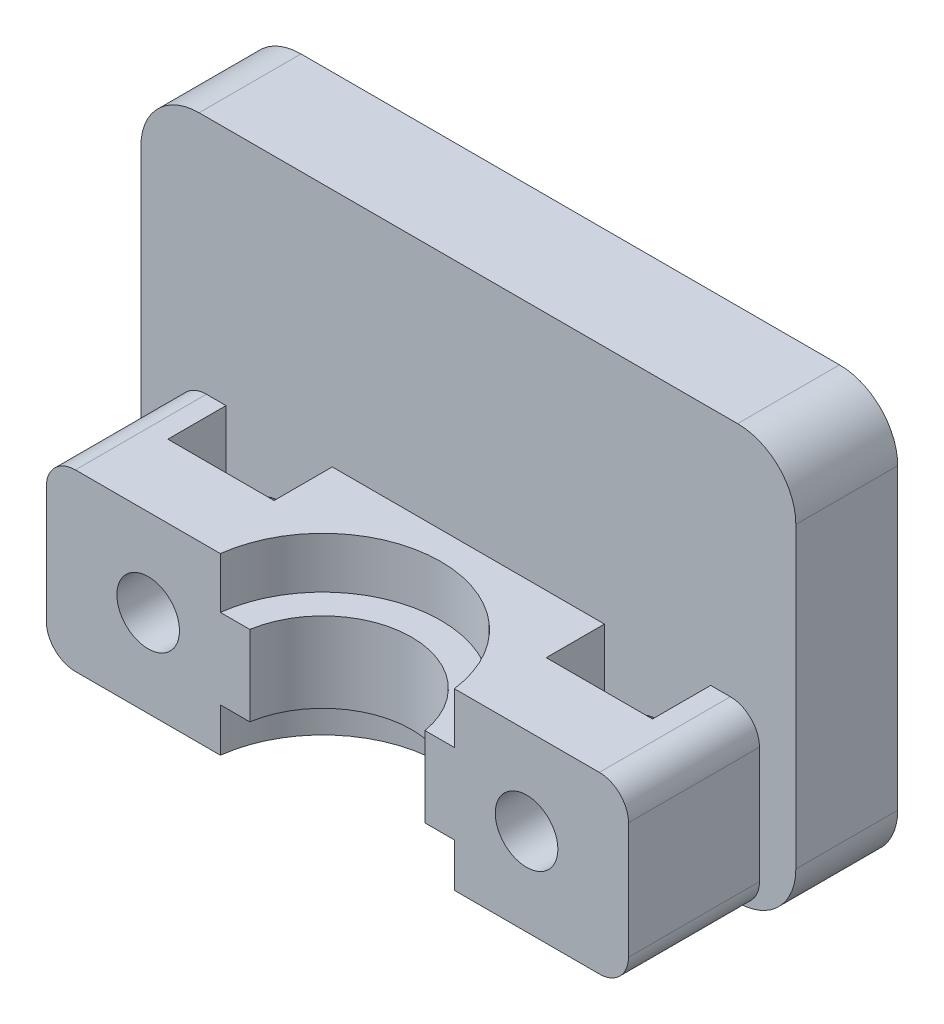
ISO-10303-21;
HEADER;
FILE_DESCRIPTION(('STEP AP214'),'2;1');
FILE_NAME('part.step','',(''),(''),'','','');
FILE_SCHEMA(('AUTOMOTIVE_DESIGN { 1 0 10303 214 1 1 1 1 }'));
ENDSEC;
DATA;
#1=APPLICATION_CONTEXT('core data for automotive mechanical design processes');
#2=APPLICATION_PROTOCOL_DEFINITION('international standard','automotive_design',2000,#1);
#3=PRODUCT_CONTEXT('',#1,'mechanical');
#4=PRODUCT('Part','Part','',(#3));
#5=PRODUCT_RELATED_PRODUCT_CATEGORY('part','',(#4));
#6=PRODUCT_DEFINITION_FORMATION('','',#4);
#7=PRODUCT_DEFINITION_CONTEXT('part definition',#1,'design');
#8=PRODUCT_DEFINITION('design','',#6,#7);
#9=PRODUCT_DEFINITION_SHAPE('','',#8);
#10=(LENGTH_UNIT() NAMED_UNIT(*) SI_UNIT(.MILLI.,.METRE.));
#11=(NAMED_UNIT(*) PLANE_ANGLE_UNIT() SI_UNIT($,.RADIAN.));
#12=(NAMED_UNIT(*) SI_UNIT($,.STERADIAN.) SOLID_ANGLE_UNIT());
#13=UNCERTAINTY_MEASURE_WITH_UNIT(LENGTH_MEASURE(1.E-05),#10,'distance_accuracy_value','');
#14=(GEOMETRIC_REPRESENTATION_CONTEXT(3) GLOBAL_UNCERTAINTY_ASSIGNED_CONTEXT((#13)) GLOBAL_UNIT_ASSIGNED_CONTEXT((#10,
#11,#12)) REPRESENTATION_CONTEXT('',''));
#15=CARTESIAN_POINT('',(0.,0.,0.));
#16=DIRECTION('',(0.,0.,1.));
#17=DIRECTION('',(1.,0.,0.));
#18=AXIS2_PLACEMENT_3D('',#15,#16,#17);
#19=CARTESIAN_POINT('',(-18.5,18.5,6.));
#20=DIRECTION('',(0.,0.,-1.));
#21=DIRECTION('',(1.,0.,0.));
#22=AXIS2_PLACEMENT_3D('',#19,#20,#21);
#23=CYLINDRICAL_SURFACE('',#22,4.);
#24=DIRECTION('',(0.,0.,1.));
#25=VECTOR('',#24,1.);
#26=CARTESIAN_POINT('',(-18.5,22.5,6.));
#27=LINE('',#26,#25);
#28=CARTESIAN_POINT('',(-18.5,22.5,8.));
#29=VERTEX_POINT('',#28);
#30=CARTESIAN_POINT('',(-18.5,22.5,15.));
#31=VERTEX_POINT('',#30);
#32=EDGE_CURVE('E373',#29,#31,#27,.T.);
#33=ORIENTED_EDGE('',*,*,#32,.F.);
#34=CARTESIAN_POINT('',(-18.5,18.5,8.));
#35=DIRECTION('',(0.,0.,-1.));
#36=DIRECTION('',(-1.,0.,0.));
#37=AXIS2_PLACEMENT_3D('',#34,#35,#36);
#38=CIRCLE('',#37,4.);
#39=CARTESIAN_POINT('',(-22.5,18.5,8.));
#40=VERTEX_POINT('',#39);
#41=EDGE_CURVE('E258',#40,#29,#38,.T.);
#42=ORIENTED_EDGE('',*,*,#41,.F.);
#43=DIRECTION('',(0.,0.,-1.));
#44=VECTOR('',#43,1.);
#45=CARTESIAN_POINT('',(-22.5,18.5,0.));
#46=LINE('',#45,#44);
#47=CARTESIAN_POINT('',(-22.5,18.5,15.));
#48=VERTEX_POINT('',#47);
#49=EDGE_CURVE('E256',#48,#40,#46,.T.);
#50=ORIENTED_EDGE('',*,*,#49,.F.);
#51=CARTESIAN_POINT('',(-18.5,18.5,15.));
#52=DIRECTION('',(0.,0.,-1.));
#53=DIRECTION('',(-1.,0.,0.));
#54=AXIS2_PLACEMENT_3D('',#51,#52,#53);
#55=CIRCLE('',#54,4.);
#56=EDGE_CURVE('E540',#48,#31,#55,.T.);
#57=ORIENTED_EDGE('',*,*,#56,.T.);
#58=EDGE_LOOP('',(#33,#42,#50,#57));
#59=FACE_BOUND('',#58,.T.);
#60=ADVANCED_FACE('F41',(#59),#23,.T.);
#61=CARTESIAN_POINT('',(18.5,18.5,6.));
#62=DIRECTION('',(0.,0.,1.));
#63=DIRECTION('',(-1.,0.,0.));
#64=AXIS2_PLACEMENT_3D('',#61,#62,#63);
#65=CYLINDRICAL_SURFACE('',#64,4.);
#66=DIRECTION('',(0.,0.,1.));
#67=VECTOR('',#66,1.);
#68=CARTESIAN_POINT('',(22.5,18.5,6.));
#69=LINE('',#68,#67);
#70=CARTESIAN_POINT('',(22.5,18.5,8.));
#71=VERTEX_POINT('',#70);
#72=CARTESIAN_POINT('',(22.5,18.5,15.));
#73=VERTEX_POINT('',#72);
#74=EDGE_CURVE('E467',#71,#73,#69,.T.);
#75=ORIENTED_EDGE('',*,*,#74,.F.);
#76=CARTESIAN_POINT('',(18.5,18.5,8.));
#77=DIRECTION('',(0.,0.,-1.));
#78=DIRECTION('',(-1.,0.,0.));
#79=AXIS2_PLACEMENT_3D('',#76,#77,#78);
#80=CIRCLE('',#79,4.);
#81=CARTESIAN_POINT('',(18.5,22.5,8.));
#82=VERTEX_POINT('',#81);
#83=EDGE_CURVE('E579',#82,#71,#80,.T.);
#84=ORIENTED_EDGE('',*,*,#83,.F.);
#85=DIRECTION('',(0.,0.,-1.));
#86=VECTOR('',#85,1.);
#87=CARTESIAN_POINT('',(18.5,22.5,6.));
#88=LINE('',#87,#86);
#89=CARTESIAN_POINT('',(18.5,22.5,15.));
#90=VERTEX_POINT('',#89);
#91=EDGE_CURVE('E369',#90,#82,#88,.T.);
#92=ORIENTED_EDGE('',*,*,#91,.F.);
#93=CARTESIAN_POINT('',(18.5,18.5,15.));
#94=DIRECTION('',(0.,0.,-1.));
#95=DIRECTION('',(-1.,0.,0.));
#96=AXIS2_PLACEMENT_3D('',#93,#94,#95);
#97=CIRCLE('',#96,4.);
#98=EDGE_CURVE('E532',#90,#73,#97,.T.);
#99=ORIENTED_EDGE('',*,*,#98,.T.);
#100=EDGE_LOOP('',(#75,#84,#92,#99));
#101=FACE_BOUND('',#100,.T.);
#102=ADVANCED_FACE('F618',(#101),#65,.T.);
#103=CARTESIAN_POINT('',(0.,22.5,6.));
#104=DIRECTION('',(0.,1.,0.));
#105=DIRECTION('',(1.,0.,0.));
#106=AXIS2_PLACEMENT_3D('',#103,#104,#105);
#107=PLANE('',#106);
#108=ORIENTED_EDGE('',*,*,#91,.T.);
#109=DIRECTION('',(1.,0.,0.));
#110=VECTOR('',#109,1.);
#111=CARTESIAN_POINT('',(-18.5,22.5,8.));
#112=LINE('',#111,#110);
#113=EDGE_CURVE('E582',#29,#82,#112,.T.);
#114=ORIENTED_EDGE('',*,*,#113,.F.);
#115=ORIENTED_EDGE('',*,*,#32,.T.);
#116=DIRECTION('',(1.,0.,0.));
#117=VECTOR('',#116,1.);
#118=CARTESIAN_POINT('',(18.5,22.5,15.));
#119=LINE('',#118,#117);
#120=EDGE_CURVE('E536',#31,#90,#119,.T.);
#121=ORIENTED_EDGE('',*,*,#120,.T.);
#122=EDGE_LOOP('',(#108,#114,#115,#121));
#123=FACE_BOUND('',#122,.T.);
#124=ADVANCED_FACE('F625',(#123),#107,.T.);
#125=CARTESIAN_POINT('',(-22.5,0.,6.));
#126=DIRECTION('',(1.,0.,0.));
#127=DIRECTION('',(0.,0.,1.));
#128=AXIS2_PLACEMENT_3D('',#125,#126,#127);
#129=PLANE('',#128);
#130=DIRECTION('',(0.,1.,0.));
#131=VECTOR('',#130,1.);
#132=CARTESIAN_POINT('',(-22.5,-2.,8.));
#133=LINE('',#132,#131);
#134=CARTESIAN_POINT('',(-22.5,-2.,8.));
#135=VERTEX_POINT('',#134);
#136=EDGE_CURVE('E240',#135,#40,#133,.T.);
#137=ORIENTED_EDGE('',*,*,#136,.F.);
#138=DIRECTION('',(0.,0.,-1.));
#139=VECTOR('',#138,1.);
#140=CARTESIAN_POINT('',(-22.5,-2.,6.));
#141=LINE('',#140,#139);
#142=CARTESIAN_POINT('',(-22.5,-2.,15.));
#143=VERTEX_POINT('',#142);
#144=EDGE_CURVE('E254',#135,#143,#141,.F.);
#145=ORIENTED_EDGE('',*,*,#144,.T.);
#146=DIRECTION('',(0.,1.,0.));
#147=VECTOR('',#146,1.);
#148=CARTESIAN_POINT('',(-22.5,18.5,15.));
#149=LINE('',#148,#147);
#150=EDGE_CURVE('E544',#143,#48,#149,.T.);
#151=ORIENTED_EDGE('',*,*,#150,.T.);
#152=ORIENTED_EDGE('',*,*,#49,.T.);
#153=EDGE_LOOP('',(#137,#145,#151,#152));
#154=FACE_BOUND('',#153,.T.);
#155=ADVANCED_FACE('F252',(#154),#129,.F.);
#156=CARTESIAN_POINT('',(-3.48623514175416,-6.,24.));
#157=DIRECTION('',(0.,1.,0.));
#158=DIRECTION('',(1.,0.,0.));
#159=AXIS2_PLACEMENT_3D('',#156,#157,#158);
#160=PLANE('',#159);
#161=DIRECTION('',(1.,0.,0.));
#162=VECTOR('',#161,1.);
#163=CARTESIAN_POINT('',(-12.7345621585846,-6.,15.));
#164=LINE('',#163,#162);
#165=CARTESIAN_POINT('',(-16.65,-6.,15.));
#166=VERTEX_POINT('',#165);
#167=CARTESIAN_POINT('',(-9.35,-6.,15.));
#168=VERTEX_POINT('',#167);
#169=EDGE_CURVE('E277',#166,#168,#164,.T.);
#170=ORIENTED_EDGE('',*,*,#169,.F.);
#171=DIRECTION('',(0.,0.,-1.));
#172=VECTOR('',#171,1.);
#173=CARTESIAN_POINT('',(-16.65,-6.,16.4911967590451));
#174=LINE('',#173,#172);
#175=CARTESIAN_POINT('',(-16.65,-6.,19.));
#176=VERTEX_POINT('',#175);
#177=EDGE_CURVE('E400',#176,#166,#174,.T.);
#178=ORIENTED_EDGE('',*,*,#177,.F.);
#179=DIRECTION('',(1.,0.,0.));
#180=VECTOR('',#179,1.);
#181=CARTESIAN_POINT('',(-12.7345621585846,-6.,19.));
#182=LINE('',#181,#180);
#183=CARTESIAN_POINT('',(-9.35,-6.,19.));
#184=VERTEX_POINT('',#183);
#185=EDGE_CURVE('E421',#176,#184,#182,.T.);
#186=ORIENTED_EDGE('',*,*,#185,.T.);
#187=DIRECTION('',(0.,0.,-1.));
#188=VECTOR('',#187,1.);
#189=CARTESIAN_POINT('',(-9.35,-6.,17.5088032409549));
#190=LINE('',#189,#188);
#191=EDGE_CURVE('E424',#184,#168,#190,.T.);
#192=ORIENTED_EDGE('',*,*,#191,.T.);
#193=EDGE_LOOP('',(#170,#178,#186,#192));
#194=FACE_BOUND('',#193,.T.);
#195=DIRECTION('',(-1.,0.,0.));
#196=VECTOR('',#195,1.);
#197=CARTESIAN_POINT('',(13.6458841152489,-6.,15.));
#198=LINE('',#197,#196);
#199=CARTESIAN_POINT('',(16.65,-6.,15.));
#200=VERTEX_POINT('',#199);
#201=CARTESIAN_POINT('',(9.35,-6.,15.));
#202=VERTEX_POINT('',#201);
#203=EDGE_CURVE('E492',#200,#202,#198,.T.);
#204=ORIENTED_EDGE('',*,*,#203,.T.);
#205=DIRECTION('',(0.,0.,-1.));
#206=VECTOR('',#205,1.);
#207=CARTESIAN_POINT('',(9.35,-6.,16.4911967590451));
#208=LINE('',#207,#206);
#209=CARTESIAN_POINT('',(9.35,-6.,19.));
#210=VERTEX_POINT('',#209);
#211=EDGE_CURVE('E314',#210,#202,#208,.T.);
#212=ORIENTED_EDGE('',*,*,#211,.F.);
#213=DIRECTION('',(-1.,0.,0.));
#214=VECTOR('',#213,1.);
#215=CARTESIAN_POINT('',(13.6458841152489,-6.,19.));
#216=LINE('',#215,#214);
#217=CARTESIAN_POINT('',(16.65,-6.,19.));
#218=VERTEX_POINT('',#217);
#219=EDGE_CURVE('E283',#218,#210,#216,.T.);
#220=ORIENTED_EDGE('',*,*,#219,.F.);
#221=DIRECTION('',(0.,0.,-1.));
#222=VECTOR('',#221,1.);
#223=CARTESIAN_POINT('',(16.65,-6.,16.4911967590451));
#224=LINE('',#223,#222);
#225=EDGE_CURVE('E385',#218,#200,#224,.T.);
#226=ORIENTED_EDGE('',*,*,#225,.T.);
#227=EDGE_LOOP('',(#204,#212,#220,#226));
#228=FACE_BOUND('',#227,.T.);
#229=DIRECTION('',(-1.,0.,0.));
#230=VECTOR('',#229,1.);
#231=CARTESIAN_POINT('',(18.5,-6.,8.));
#232=LINE('',#231,#230);
#233=CARTESIAN_POINT('',(18.5,-6.,8.));
#234=VERTEX_POINT('',#233);
#235=CARTESIAN_POINT('',(-18.5,-6.,8.));
#236=VERTEX_POINT('',#235);
#237=EDGE_CURVE('E243',#234,#236,#232,.T.);
#238=ORIENTED_EDGE('',*,*,#237,.F.);
#239=DIRECTION('',(0.,0.,-1.));
#240=VECTOR('',#239,1.);
#241=CARTESIAN_POINT('',(18.5,-6.,6.));
#242=LINE('',#241,#240);
#243=CARTESIAN_POINT('',(18.5,-6.,15.));
#244=VERTEX_POINT('',#243);
#245=EDGE_CURVE('E271',#234,#244,#242,.F.);
#246=ORIENTED_EDGE('',*,*,#245,.T.);
#247=DIRECTION('',(-1.,0.,0.));
#248=VECTOR('',#247,1.);
#249=CARTESIAN_POINT('',(18.,-6.,15.));
#250=LINE('',#249,#248);
#251=CARTESIAN_POINT('',(18.,-6.,15.));
#252=VERTEX_POINT('',#251);
#253=EDGE_CURVE('E520',#244,#252,#250,.T.);
#254=ORIENTED_EDGE('',*,*,#253,.T.);
#255=DIRECTION('',(0.,0.,1.));
#256=VECTOR('',#255,1.);
#257=CARTESIAN_POINT('',(18.,-6.,24.));
#258=LINE('',#257,#256);
#259=CARTESIAN_POINT('',(18.,-6.,24.));
#260=VERTEX_POINT('',#259);
#261=EDGE_CURVE('E397',#252,#260,#258,.T.);
#262=ORIENTED_EDGE('',*,*,#261,.T.);
#263=DIRECTION('',(1.,0.,0.));
#264=VECTOR('',#263,1.);
#265=CARTESIAN_POINT('',(-3.48623514175416,-6.,24.));
#266=LINE('',#265,#264);
#267=CARTESIAN_POINT('',(8.03803458564343,-6.,24.));
#268=VERTEX_POINT('',#267);
#269=EDGE_CURVE('E303',#268,#260,#266,.T.);
#270=ORIENTED_EDGE('',*,*,#269,.F.);
#271=CARTESIAN_POINT('',(0.,-6.,25.));
#272=DIRECTION('',(0.,-1.,0.));
#273=DIRECTION('',(1.,0.,0.));
#274=AXIS2_PLACEMENT_3D('',#271,#272,#273);
#275=CIRCLE('',#274,8.1);
#276=CARTESIAN_POINT('',(-8.03803458564343,-6.,24.));
#277=VERTEX_POINT('',#276);
#278=EDGE_CURVE('E296',#277,#268,#275,.T.);
#279=ORIENTED_EDGE('',*,*,#278,.F.);
#280=DIRECTION('',(1.,0.,0.));
#281=VECTOR('',#280,1.);
#282=CARTESIAN_POINT('',(-3.48623514175416,-6.,24.));
#283=LINE('',#282,#281);
#284=CARTESIAN_POINT('',(-18.,-6.,24.));
#285=VERTEX_POINT('',#284);
#286=EDGE_CURVE('E301',#285,#277,#283,.T.);
#287=ORIENTED_EDGE('',*,*,#286,.F.);
#288=DIRECTION('',(0.,0.,-1.));
#289=VECTOR('',#288,1.);
#290=CARTESIAN_POINT('',(-18.,-6.,24.));
#291=LINE('',#290,#289);
#292=CARTESIAN_POINT('',(-18.,-6.,15.));
#293=VERTEX_POINT('',#292);
#294=EDGE_CURVE('E348',#285,#293,#291,.T.);
#295=ORIENTED_EDGE('',*,*,#294,.T.);
#296=DIRECTION('',(-1.,0.,0.));
#297=VECTOR('',#296,1.);
#298=CARTESIAN_POINT('',(-18.5,-6.,15.));
#299=LINE('',#298,#297);
#300=CARTESIAN_POINT('',(-18.5,-6.,15.));
#301=VERTEX_POINT('',#300);
#302=EDGE_CURVE('E549',#293,#301,#299,.T.);
#303=ORIENTED_EDGE('',*,*,#302,.T.);
#304=DIRECTION('',(0.,0.,-1.));
#305=VECTOR('',#304,1.);
#306=CARTESIAN_POINT('',(-18.5,-6.,24.));
#307=LINE('',#306,#305);
#308=EDGE_CURVE('E266',#301,#236,#307,.T.);
#309=ORIENTED_EDGE('',*,*,#308,.T.);
#310=EDGE_LOOP('',(#238,#246,#254,#262,#270,#279,#287,#295,#303,#309));
#311=FACE_BOUND('',#310,.T.);
#312=ADVANCED_FACE('F649',(#194,#228,#311),#160,.F.);
#313=CARTESIAN_POINT('',(22.5,0.,6.));
#314=DIRECTION('',(1.,0.,0.));
#315=DIRECTION('',(0.,0.,1.));
#316=AXIS2_PLACEMENT_3D('',#313,#314,#315);
#317=PLANE('',#316);
#318=DIRECTION('',(0.,0.,-1.));
#319=VECTOR('',#318,1.);
#320=CARTESIAN_POINT('',(22.5,-2.,0.));
#321=LINE('',#320,#319);
#322=CARTESIAN_POINT('',(22.5,-2.,15.));
#323=VERTEX_POINT('',#322);
#324=CARTESIAN_POINT('',(22.5,-2.,8.));
#325=VERTEX_POINT('',#324);
#326=EDGE_CURVE('E265',#323,#325,#321,.T.);
#327=ORIENTED_EDGE('',*,*,#326,.T.);
#328=DIRECTION('',(0.,-1.,0.));
#329=VECTOR('',#328,1.);
#330=CARTESIAN_POINT('',(22.5,18.5,8.));
#331=LINE('',#330,#329);
#332=EDGE_CURVE('E57',#71,#325,#331,.T.);
#333=ORIENTED_EDGE('',*,*,#332,.F.);
#334=ORIENTED_EDGE('',*,*,#74,.T.);
#335=DIRECTION('',(0.,-1.,0.));
#336=VECTOR('',#335,1.);
#337=CARTESIAN_POINT('',(22.5,-2.,15.));
#338=LINE('',#337,#336);
#339=EDGE_CURVE('E528',#73,#323,#338,.T.);
#340=ORIENTED_EDGE('',*,*,#339,.T.);
#341=EDGE_LOOP('',(#327,#333,#334,#340));
#342=FACE_BOUND('',#341,.T.);
#343=ADVANCED_FACE('F652',(#342),#317,.T.);
#344=CARTESIAN_POINT('',(-18.5,-2.,24.));
#345=DIRECTION('',(0.,0.,-1.));
#346=DIRECTION('',(-1.,0.,0.));
#347=AXIS2_PLACEMENT_3D('',#344,#345,#346);
#348=CYLINDRICAL_SURFACE('',#347,4.);
#349=ORIENTED_EDGE('',*,*,#144,.F.);
#350=CARTESIAN_POINT('',(-18.5,-2.,8.));
#351=DIRECTION('',(0.,0.,-1.));
#352=DIRECTION('',(-1.,0.,0.));
#353=AXIS2_PLACEMENT_3D('',#350,#351,#352);
#354=CIRCLE('',#353,4.);
#355=EDGE_CURVE('E237',#236,#135,#354,.T.);
#356=ORIENTED_EDGE('',*,*,#355,.F.);
#357=ORIENTED_EDGE('',*,*,#308,.F.);
#358=CARTESIAN_POINT('',(-18.5,-2.,15.));
#359=DIRECTION('',(0.,0.,-1.));
#360=DIRECTION('',(-1.,0.,0.));
#361=AXIS2_PLACEMENT_3D('',#358,#359,#360);
#362=CIRCLE('',#361,4.);
#363=EDGE_CURVE('E263',#301,#143,#362,.T.);
#364=ORIENTED_EDGE('',*,*,#363,.T.);
#365=EDGE_LOOP('',(#349,#356,#357,#364));
#366=FACE_BOUND('',#365,.T.);
#367=ADVANCED_FACE('F261',(#366),#348,.T.);
#368=CARTESIAN_POINT('',(18.5,-2.,6.));
#369=DIRECTION('',(0.,0.,1.));
#370=DIRECTION('',(1.,0.,0.));
#371=AXIS2_PLACEMENT_3D('',#368,#369,#370);
#372=CYLINDRICAL_SURFACE('',#371,4.);
#373=ORIENTED_EDGE('',*,*,#245,.F.);
#374=CARTESIAN_POINT('',(18.5,-2.,8.));
#375=DIRECTION('',(0.,0.,-1.));
#376=DIRECTION('',(-1.,0.,0.));
#377=AXIS2_PLACEMENT_3D('',#374,#375,#376);
#378=CIRCLE('',#377,4.);
#379=EDGE_CURVE('E574',#325,#234,#378,.T.);
#380=ORIENTED_EDGE('',*,*,#379,.F.);
#381=ORIENTED_EDGE('',*,*,#326,.F.);
#382=CARTESIAN_POINT('',(18.5,-2.,15.));
#383=DIRECTION('',(0.,0.,-1.));
#384=DIRECTION('',(-1.,0.,0.));
#385=AXIS2_PLACEMENT_3D('',#382,#383,#384);
#386=CIRCLE('',#385,4.);
#387=EDGE_CURVE('E468',#323,#244,#386,.T.);
#388=ORIENTED_EDGE('',*,*,#387,.T.);
#389=EDGE_LOOP('',(#373,#380,#381,#388));
#390=FACE_BOUND('',#389,.T.);
#391=ADVANCED_FACE('F43',(#390),#372,.T.);
#392=CARTESIAN_POINT('',(20.,3.13712009787558,24.));
#393=DIRECTION('',(1.,0.,0.));
#394=DIRECTION('',(0.,0.,1.));
#395=AXIS2_PLACEMENT_3D('',#392,#393,#394);
#396=PLANE('',#395);
#397=DIRECTION('',(0.,0.,-1.));
#398=VECTOR('',#397,1.);
#399=CARTESIAN_POINT('',(20.,-4.,6.));
#400=LINE('',#399,#398);
#401=CARTESIAN_POINT('',(20.,-4.,24.));
#402=VERTEX_POINT('',#401);
#403=CARTESIAN_POINT('',(20.,-4.,15.));
#404=VERTEX_POINT('',#403);
#405=EDGE_CURVE('E331',#402,#404,#400,.T.);
#406=ORIENTED_EDGE('',*,*,#405,.T.);
#407=DIRECTION('',(0.,1.,0.));
#408=VECTOR('',#407,1.);
#409=CARTESIAN_POINT('',(20.,4.,15.));
#410=LINE('',#409,#408);
#411=CARTESIAN_POINT('',(20.,4.,15.));
#412=VERTEX_POINT('',#411);
#413=EDGE_CURVE('E65',#404,#412,#410,.T.);
#414=ORIENTED_EDGE('',*,*,#413,.T.);
#415=DIRECTION('',(0.,0.,1.));
#416=VECTOR('',#415,1.);
#417=CARTESIAN_POINT('',(20.,4.,24.));
#418=LINE('',#417,#416);
#419=CARTESIAN_POINT('',(20.,4.,24.));
#420=VERTEX_POINT('',#419);
#421=EDGE_CURVE('E442',#412,#420,#418,.T.);
#422=ORIENTED_EDGE('',*,*,#421,.T.);
#423=DIRECTION('',(0.,-1.,0.));
#424=VECTOR('',#423,1.);
#425=CARTESIAN_POINT('',(20.,3.13712009787558,24.));
#426=LINE('',#425,#424);
#427=EDGE_CURVE('E326',#420,#402,#426,.T.);
#428=ORIENTED_EDGE('',*,*,#427,.T.);
#429=EDGE_LOOP('',(#406,#414,#422,#428));
#430=FACE_BOUND('',#429,.T.);
#431=ADVANCED_FACE('F630',(#430),#396,.T.);
#432=CARTESIAN_POINT('',(18.,4.,24.));
#433=DIRECTION('',(0.,0.,1.));
#434=DIRECTION('',(-1.,0.,0.));
#435=AXIS2_PLACEMENT_3D('',#432,#433,#434);
#436=CYLINDRICAL_SURFACE('',#435,2.);
#437=ORIENTED_EDGE('',*,*,#421,.F.);
#438=CARTESIAN_POINT('',(18.,4.,15.));
#439=DIRECTION('',(0.,0.,-1.));
#440=DIRECTION('',(-1.,0.,0.));
#441=AXIS2_PLACEMENT_3D('',#438,#439,#440);
#442=CIRCLE('',#441,2.);
#443=CARTESIAN_POINT('',(18.,6.,15.));
#444=VERTEX_POINT('',#443);
#445=EDGE_CURVE('E565',#412,#444,#442,.F.);
#446=ORIENTED_EDGE('',*,*,#445,.T.);
#447=DIRECTION('',(0.,0.,-1.));
#448=VECTOR('',#447,1.);
#449=CARTESIAN_POINT('',(18.,6.,24.));
#450=LINE('',#449,#448);
#451=CARTESIAN_POINT('',(18.,6.,24.));
#452=VERTEX_POINT('',#451);
#453=EDGE_CURVE('E312',#452,#444,#450,.T.);
#454=ORIENTED_EDGE('',*,*,#453,.F.);
#455=CARTESIAN_POINT('',(18.,4.,24.));
#456=DIRECTION('',(0.,0.,1.));
#457=DIRECTION('',(1.,0.,0.));
#458=AXIS2_PLACEMENT_3D('',#455,#456,#457);
#459=CIRCLE('',#458,2.);
#460=EDGE_CURVE('E431',#420,#452,#459,.T.);
#461=ORIENTED_EDGE('',*,*,#460,.F.);
#462=EDGE_LOOP('',(#437,#446,#454,#461));
#463=FACE_BOUND('',#462,.T.);
#464=ADVANCED_FACE('F645',(#463),#436,.T.);
#465=CARTESIAN_POINT('',(-18.,-4.,24.));
#466=DIRECTION('',(0.,0.,1.));
#467=DIRECTION('',(-1.,0.,0.));
#468=AXIS2_PLACEMENT_3D('',#465,#466,#467);
#469=CYLINDRICAL_SURFACE('',#468,2.);
#470=DIRECTION('',(0.,0.,1.));
#471=VECTOR('',#470,1.);
#472=CARTESIAN_POINT('',(-20.,-4.,24.));
#473=LINE('',#472,#471);
#474=CARTESIAN_POINT('',(-20.,-4.,15.));
#475=VERTEX_POINT('',#474);
#476=CARTESIAN_POINT('',(-20.,-4.,24.));
#477=VERTEX_POINT('',#476);
#478=EDGE_CURVE('E380',#475,#477,#473,.T.);
#479=ORIENTED_EDGE('',*,*,#478,.F.);
#480=CARTESIAN_POINT('',(-18.,-4.,15.));
#481=DIRECTION('',(0.,0.,-1.));
#482=DIRECTION('',(-1.,0.,0.));
#483=AXIS2_PLACEMENT_3D('',#480,#481,#482);
#484=CIRCLE('',#483,2.);
#485=EDGE_CURVE('E553',#475,#293,#484,.F.);
#486=ORIENTED_EDGE('',*,*,#485,.T.);
#487=ORIENTED_EDGE('',*,*,#294,.F.);
#488=CARTESIAN_POINT('',(-18.,-4.,24.));
#489=DIRECTION('',(0.,0.,1.));
#490=DIRECTION('',(1.,0.,0.));
#491=AXIS2_PLACEMENT_3D('',#488,#489,#490);
#492=CIRCLE('',#491,2.);
#493=EDGE_CURVE('E325',#477,#285,#492,.T.);
#494=ORIENTED_EDGE('',*,*,#493,.F.);
#495=EDGE_LOOP('',(#479,#486,#487,#494));
#496=FACE_BOUND('',#495,.T.);
#497=ADVANCED_FACE('F637',(#496),#469,.T.);
#498=CARTESIAN_POINT('',(18.,-4.,24.));
#499=DIRECTION('',(0.,0.,-1.));
#500=DIRECTION('',(1.,0.,0.));
#501=AXIS2_PLACEMENT_3D('',#498,#499,#500);
#502=CYLINDRICAL_SURFACE('',#501,2.);
#503=ORIENTED_EDGE('',*,*,#261,.F.);
#504=CARTESIAN_POINT('',(18.,-4.,15.));
#505=DIRECTION('',(0.,0.,-1.));
#506=DIRECTION('',(-1.,0.,0.));
#507=AXIS2_PLACEMENT_3D('',#504,#505,#506);
#508=CIRCLE('',#507,2.);
#509=EDGE_CURVE('E524',#252,#404,#508,.F.);
#510=ORIENTED_EDGE('',*,*,#509,.T.);
#511=ORIENTED_EDGE('',*,*,#405,.F.);
#512=CARTESIAN_POINT('',(18.,-4.,24.));
#513=DIRECTION('',(0.,0.,1.));
#514=DIRECTION('',(1.,0.,0.));
#515=AXIS2_PLACEMENT_3D('',#512,#513,#514);
#516=CIRCLE('',#515,2.);
#517=EDGE_CURVE('E308',#260,#402,#516,.T.);
#518=ORIENTED_EDGE('',*,*,#517,.F.);
#519=EDGE_LOOP('',(#503,#510,#511,#518));
#520=FACE_BOUND('',#519,.T.);
#521=ADVANCED_FACE('F633',(#520),#502,.T.);
#522=CARTESIAN_POINT('',(-18.,4.,24.));
#523=DIRECTION('',(0.,0.,-1.));
#524=DIRECTION('',(1.,0.,0.));
#525=AXIS2_PLACEMENT_3D('',#522,#523,#524);
#526=CYLINDRICAL_SURFACE('',#525,2.);
#527=DIRECTION('',(0.,0.,1.));
#528=VECTOR('',#527,1.);
#529=CARTESIAN_POINT('',(-18.,6.,24.));
#530=LINE('',#529,#528);
#531=CARTESIAN_POINT('',(-18.,6.,15.));
#532=VERTEX_POINT('',#531);
#533=CARTESIAN_POINT('',(-18.,6.,24.));
#534=VERTEX_POINT('',#533);
#535=EDGE_CURVE('E309',#532,#534,#530,.T.);
#536=ORIENTED_EDGE('',*,*,#535,.F.);
#537=CARTESIAN_POINT('',(-18.,4.,15.));
#538=DIRECTION('',(0.,0.,-1.));
#539=DIRECTION('',(-1.,0.,0.));
#540=AXIS2_PLACEMENT_3D('',#537,#538,#539);
#541=CIRCLE('',#540,2.);
#542=CARTESIAN_POINT('',(-20.,4.,15.));
#543=VERTEX_POINT('',#542);
#544=EDGE_CURVE('E559',#532,#543,#541,.F.);
#545=ORIENTED_EDGE('',*,*,#544,.T.);
#546=DIRECTION('',(0.,0.,-1.));
#547=VECTOR('',#546,1.);
#548=CARTESIAN_POINT('',(-20.,4.,6.));
#549=LINE('',#548,#547);
#550=CARTESIAN_POINT('',(-20.,4.,24.));
#551=VERTEX_POINT('',#550);
#552=EDGE_CURVE('E324',#551,#543,#549,.T.);
#553=ORIENTED_EDGE('',*,*,#552,.F.);
#554=CARTESIAN_POINT('',(-18.,4.,24.));
#555=DIRECTION('',(0.,0.,1.));
#556=DIRECTION('',(1.,0.,0.));
#557=AXIS2_PLACEMENT_3D('',#554,#555,#556);
#558=CIRCLE('',#557,2.);
#559=EDGE_CURVE('E307',#534,#551,#558,.T.);
#560=ORIENTED_EDGE('',*,*,#559,.F.);
#561=EDGE_LOOP('',(#536,#545,#553,#560));
#562=FACE_BOUND('',#561,.T.);
#563=ADVANCED_FACE('F636',(#562),#526,.T.);
#564=CARTESIAN_POINT('',(-20.,7.82313179783523,24.));
#565=DIRECTION('',(1.,0.,0.));
#566=DIRECTION('',(0.,0.,1.));
#567=AXIS2_PLACEMENT_3D('',#564,#565,#566);
#568=PLANE('',#567);
#569=DIRECTION('',(0.,-1.,0.));
#570=VECTOR('',#569,1.);
#571=CARTESIAN_POINT('',(-20.,-4.,15.));
#572=LINE('',#571,#570);
#573=EDGE_CURVE('E556',#543,#475,#572,.T.);
#574=ORIENTED_EDGE('',*,*,#573,.T.);
#575=ORIENTED_EDGE('',*,*,#478,.T.);
#576=DIRECTION('',(0.,-1.,0.));
#577=VECTOR('',#576,1.);
#578=CARTESIAN_POINT('',(-20.,7.82313179783523,24.));
#579=LINE('',#578,#577);
#580=EDGE_CURVE('E320',#551,#477,#579,.T.);
#581=ORIENTED_EDGE('',*,*,#580,.F.);
#582=ORIENTED_EDGE('',*,*,#552,.T.);
#583=EDGE_LOOP('',(#574,#575,#581,#582));
#584=FACE_BOUND('',#583,.T.);
#585=ADVANCED_FACE('F677',(#584),#568,.F.);
#586=CARTESIAN_POINT('',(3.66567261517048,6.,24.));
#587=DIRECTION('',(0.,1.,0.));
#588=DIRECTION('',(1.,0.,0.));
#589=AXIS2_PLACEMENT_3D('',#586,#587,#588);
#590=PLANE('',#589);
#591=ORIENTED_EDGE('',*,*,#453,.T.);
#592=DIRECTION('',(-1.,0.,0.));
#593=VECTOR('',#592,1.);
#594=CARTESIAN_POINT('',(9.35,6.,15.));
#595=LINE('',#594,#593);
#596=CARTESIAN_POINT('',(16.65,6.,15.));
#597=VERTEX_POINT('',#596);
#598=EDGE_CURVE('E562',#444,#597,#595,.T.);
#599=ORIENTED_EDGE('',*,*,#598,.T.);
#600=DIRECTION('',(0.,0.,1.));
#601=VECTOR('',#600,1.);
#602=CARTESIAN_POINT('',(16.65,6.,24.));
#603=LINE('',#602,#601);
#604=CARTESIAN_POINT('',(16.65,6.,19.));
#605=VERTEX_POINT('',#604);
#606=EDGE_CURVE('E448',#597,#605,#603,.T.);
#607=ORIENTED_EDGE('',*,*,#606,.T.);
#608=DIRECTION('',(1.,0.,0.));
#609=VECTOR('',#608,1.);
#610=CARTESIAN_POINT('',(3.66567261517048,6.,19.));
#611=LINE('',#610,#609);
#612=CARTESIAN_POINT('',(9.35,6.,19.));
#613=VERTEX_POINT('',#612);
#614=EDGE_CURVE('E319',#613,#605,#611,.T.);
#615=ORIENTED_EDGE('',*,*,#614,.F.);
#616=DIRECTION('',(0.,0.,1.));
#617=VECTOR('',#616,1.);
#618=CARTESIAN_POINT('',(9.35,6.,24.));
#619=LINE('',#618,#617);
#620=CARTESIAN_POINT('',(9.35,6.,15.));
#621=VERTEX_POINT('',#620);
#622=EDGE_CURVE('E427',#621,#613,#619,.T.);
#623=ORIENTED_EDGE('',*,*,#622,.F.);
#624=DIRECTION('',(-1.,0.,0.));
#625=VECTOR('',#624,1.);
#626=CARTESIAN_POINT('',(3.66567261517048,6.,15.));
#627=LINE('',#626,#625);
#628=CARTESIAN_POINT('',(-9.35,6.,15.));
#629=VERTEX_POINT('',#628);
#630=EDGE_CURVE('E11',#621,#629,#627,.T.);
#631=ORIENTED_EDGE('',*,*,#630,.T.);
#632=DIRECTION('',(0.,0.,1.));
#633=VECTOR('',#632,1.);
#634=CARTESIAN_POINT('',(-9.35,6.,24.));
#635=LINE('',#634,#633);
#636=CARTESIAN_POINT('',(-9.35,6.,19.));
#637=VERTEX_POINT('',#636);
#638=EDGE_CURVE('E407',#629,#637,#635,.T.);
#639=ORIENTED_EDGE('',*,*,#638,.T.);
#640=DIRECTION('',(-1.,0.,0.));
#641=VECTOR('',#640,1.);
#642=CARTESIAN_POINT('',(3.66567261517048,6.,19.));
#643=LINE('',#642,#641);
#644=CARTESIAN_POINT('',(-16.65,6.,19.));
#645=VERTEX_POINT('',#644);
#646=EDGE_CURVE('E445',#637,#645,#643,.T.);
#647=ORIENTED_EDGE('',*,*,#646,.T.);
#648=DIRECTION('',(0.,0.,1.));
#649=VECTOR('',#648,1.);
#650=CARTESIAN_POINT('',(-16.65,6.,24.));
#651=LINE('',#650,#649);
#652=CARTESIAN_POINT('',(-16.65,6.,15.));
#653=VERTEX_POINT('',#652);
#654=EDGE_CURVE('E415',#653,#645,#651,.T.);
#655=ORIENTED_EDGE('',*,*,#654,.F.);
#656=EDGE_CURVE('E45',#653,#532,#627,.T.);
#657=ORIENTED_EDGE('',*,*,#656,.T.);
#658=ORIENTED_EDGE('',*,*,#535,.T.);
#659=DIRECTION('',(1.,0.,0.));
#660=VECTOR('',#659,1.);
#661=CARTESIAN_POINT('',(3.66567261517048,6.,24.));
#662=LINE('',#661,#660);
#663=CARTESIAN_POINT('',(-8.03803458564343,6.,24.));
#664=VERTEX_POINT('',#663);
#665=EDGE_CURVE('E313',#534,#664,#662,.T.);
#666=ORIENTED_EDGE('',*,*,#665,.T.);
#667=CARTESIAN_POINT('',(0.,6.,25.));
#668=DIRECTION('',(0.,1.,0.));
#669=DIRECTION('',(-1.,0.,0.));
#670=AXIS2_PLACEMENT_3D('',#667,#668,#669);
#671=CIRCLE('',#670,8.1);
#672=CARTESIAN_POINT('',(8.03803458564343,6.,24.));
#673=VERTEX_POINT('',#672);
#674=EDGE_CURVE('E362',#673,#664,#671,.T.);
#675=ORIENTED_EDGE('',*,*,#674,.F.);
#676=DIRECTION('',(1.,0.,0.));
#677=VECTOR('',#676,1.);
#678=CARTESIAN_POINT('',(3.66567261517048,6.,24.));
#679=LINE('',#678,#677);
#680=EDGE_CURVE('E381',#673,#452,#679,.T.);
#681=ORIENTED_EDGE('',*,*,#680,.T.);
#682=EDGE_LOOP('',(#591,#599,#607,#615,#623,#631,#639,#647,#655,#657,#658,#666,#675,#681));
#683=FACE_BOUND('',#682,.T.);
#684=ADVANCED_FACE('F612',(#683),#590,.T.);
#685=CARTESIAN_POINT('',(-13.,0.,9.));
#686=DIRECTION('',(0.,0.,-1.));
#687=DIRECTION('',(1.,0.,0.));
#688=AXIS2_PLACEMENT_3D('',#685,#686,#687);
#689=CYLINDRICAL_SURFACE('',#688,2.15);
#690=CARTESIAN_POINT('',(-13.,0.,24.));
#691=DIRECTION('',(0.,0.,1.));
#692=DIRECTION('',(1.,0.,0.));
#693=AXIS2_PLACEMENT_3D('',#690,#691,#692);
#694=CIRCLE('',#693,2.15);
#695=CARTESIAN_POINT('',(-10.85,0.,24.));
#696=VERTEX_POINT('',#695);
#697=EDGE_CURVE('E276',#696,#696,#694,.T.);
#698=ORIENTED_EDGE('',*,*,#697,.T.);
#699=EDGE_LOOP('',(#698));
#700=FACE_BOUND('',#699,.T.);
#701=CARTESIAN_POINT('',(-13.,0.,19.));
#702=DIRECTION('',(0.,0.,-1.));
#703=DIRECTION('',(-1.,0.,0.));
#704=AXIS2_PLACEMENT_3D('',#701,#702,#703);
#705=CIRCLE('',#704,2.15);
#706=CARTESIAN_POINT('',(-15.15,0.,19.));
#707=VERTEX_POINT('',#706);
#708=EDGE_CURVE('E248',#707,#707,#705,.T.);
#709=ORIENTED_EDGE('',*,*,#708,.T.);
#710=EDGE_LOOP('',(#709));
#711=FACE_BOUND('',#710,.T.);
#712=ADVANCED_FACE('F601',(#700,#711),#689,.F.);
#713=CARTESIAN_POINT('',(13.,0.,9.));
#714=DIRECTION('',(0.,0.,-1.));
#715=DIRECTION('',(1.,0.,0.));
#716=AXIS2_PLACEMENT_3D('',#713,#714,#715);
#717=CYLINDRICAL_SURFACE('',#716,2.15);
#718=CARTESIAN_POINT('',(13.,0.,24.));
#719=DIRECTION('',(0.,0.,1.));
#720=DIRECTION('',(1.,0.,0.));
#721=AXIS2_PLACEMENT_3D('',#718,#719,#720);
#722=CIRCLE('',#721,2.15);
#723=CARTESIAN_POINT('',(15.15,0.,24.));
#724=VERTEX_POINT('',#723);
#725=EDGE_CURVE('E292',#724,#724,#722,.T.);
#726=ORIENTED_EDGE('',*,*,#725,.T.);
#727=EDGE_LOOP('',(#726));
#728=FACE_BOUND('',#727,.T.);
#729=CARTESIAN_POINT('',(13.,0.,19.));
#730=DIRECTION('',(0.,0.,1.));
#731=DIRECTION('',(1.,0.,0.));
#732=AXIS2_PLACEMENT_3D('',#729,#730,#731);
#733=CIRCLE('',#732,2.15);
#734=CARTESIAN_POINT('',(15.15,0.,19.));
#735=VERTEX_POINT('',#734);
#736=EDGE_CURVE('E590',#735,#735,#733,.T.);
#737=ORIENTED_EDGE('',*,*,#736,.F.);
#738=EDGE_LOOP('',(#737));
#739=FACE_BOUND('',#738,.T.);
#740=ADVANCED_FACE('F598',(#728,#739),#717,.F.);
#741=CARTESIAN_POINT('',(-13.,0.,9.));
#742=DIRECTION('',(0.,0.,-1.));
#743=DIRECTION('',(1.,0.,0.));
#744=AXIS2_PLACEMENT_3D('',#741,#742,#743);
#745=CYLINDRICAL_SURFACE('',#744,2.15);
#746=CARTESIAN_POINT('',(-13.,0.,9.));
#747=DIRECTION('',(0.,0.,1.));
#748=DIRECTION('',(1.,0.,0.));
#749=AXIS2_PLACEMENT_3D('',#746,#747,#748);
#750=CIRCLE('',#749,2.15);
#751=CARTESIAN_POINT('',(-10.85,0.,9.));
#752=VERTEX_POINT('',#751);
#753=EDGE_CURVE('E420',#752,#752,#750,.T.);
#754=ORIENTED_EDGE('',*,*,#753,.F.);
#755=EDGE_LOOP('',(#754));
#756=FACE_BOUND('',#755,.T.);
#757=CARTESIAN_POINT('',(-13.,0.,15.));
#758=DIRECTION('',(0.,0.,1.));
#759=DIRECTION('',(-1.,0.,0.));
#760=AXIS2_PLACEMENT_3D('',#757,#758,#759);
#761=CIRCLE('',#760,2.15);
#762=CARTESIAN_POINT('',(-15.15,0.,15.));
#763=VERTEX_POINT('',#762);
#764=EDGE_CURVE('E389',#763,#763,#761,.T.);
#765=ORIENTED_EDGE('',*,*,#764,.T.);
#766=EDGE_LOOP('',(#765));
#767=FACE_BOUND('',#766,.T.);
#768=ADVANCED_FACE('F600',(#756,#767),#745,.F.);
#769=CARTESIAN_POINT('',(13.6458841152489,62.0247042925278,15.));
#770=DIRECTION('',(0.,0.,1.));
#771=DIRECTION('',(1.,0.,0.));
#772=AXIS2_PLACEMENT_3D('',#769,#770,#771);
#773=PLANE('',#772);
#774=DIRECTION('',(0.,-1.,0.));
#775=VECTOR('',#774,1.);
#776=CARTESIAN_POINT('',(9.35,62.0247042925278,15.));
#777=LINE('',#776,#775);
#778=EDGE_CURVE('E393',#621,#202,#777,.T.);
#779=ORIENTED_EDGE('',*,*,#778,.T.);
#780=ORIENTED_EDGE('',*,*,#203,.F.);
#781=DIRECTION('',(0.,-1.,0.));
#782=VECTOR('',#781,1.);
#783=CARTESIAN_POINT('',(16.65,62.0247042925278,15.));
#784=LINE('',#783,#782);
#785=EDGE_CURVE('E288',#597,#200,#784,.T.);
#786=ORIENTED_EDGE('',*,*,#785,.F.);
#787=ORIENTED_EDGE('',*,*,#598,.F.);
#788=ORIENTED_EDGE('',*,*,#445,.F.);
#789=ORIENTED_EDGE('',*,*,#413,.F.);
#790=ORIENTED_EDGE('',*,*,#509,.F.);
#791=ORIENTED_EDGE('',*,*,#253,.F.);
#792=ORIENTED_EDGE('',*,*,#387,.F.);
#793=ORIENTED_EDGE('',*,*,#339,.F.);
#794=ORIENTED_EDGE('',*,*,#98,.F.);
#795=ORIENTED_EDGE('',*,*,#120,.F.);
#796=ORIENTED_EDGE('',*,*,#56,.F.);
#797=ORIENTED_EDGE('',*,*,#150,.F.);
#798=ORIENTED_EDGE('',*,*,#363,.F.);
#799=ORIENTED_EDGE('',*,*,#302,.F.);
#800=ORIENTED_EDGE('',*,*,#485,.F.);
#801=ORIENTED_EDGE('',*,*,#573,.F.);
#802=ORIENTED_EDGE('',*,*,#544,.F.);
#803=ORIENTED_EDGE('',*,*,#656,.F.);
#804=DIRECTION('',(0.,-1.,0.));
#805=VECTOR('',#804,1.);
#806=CARTESIAN_POINT('',(-16.65,62.0247042925278,15.));
#807=LINE('',#806,#805);
#808=EDGE_CURVE('E281',#653,#166,#807,.T.);
#809=ORIENTED_EDGE('',*,*,#808,.T.);
#810=ORIENTED_EDGE('',*,*,#169,.T.);
#811=DIRECTION('',(0.,-1.,0.));
#812=VECTOR('',#811,1.);
#813=CARTESIAN_POINT('',(-9.35,62.0247042925278,15.));
#814=LINE('',#813,#812);
#815=EDGE_CURVE('E353',#629,#168,#814,.T.);
#816=ORIENTED_EDGE('',*,*,#815,.F.);
#817=ORIENTED_EDGE('',*,*,#630,.F.);
#818=EDGE_LOOP('',(#779,#780,#786,#787,#788,#789,#790,#791,#792,#793,#794,#795,#796,#797,#798,
#799,#800,#801,#802,#803,#809,#810,#816,#817));
#819=FACE_BOUND('',#818,.T.);
#820=CARTESIAN_POINT('',(13.,0.,15.));
#821=DIRECTION('',(0.,0.,-1.));
#822=DIRECTION('',(1.,0.,0.));
#823=AXIS2_PLACEMENT_3D('',#820,#821,#822);
#824=CIRCLE('',#823,2.15);
#825=CARTESIAN_POINT('',(15.15,0.,15.));
#826=VERTEX_POINT('',#825);
#827=EDGE_CURVE('E416',#826,#826,#824,.T.);
#828=ORIENTED_EDGE('',*,*,#827,.T.);
#829=EDGE_LOOP('',(#828));
#830=FACE_BOUND('',#829,.T.);
#831=ORIENTED_EDGE('',*,*,#764,.F.);
#832=EDGE_LOOP('',(#831));
#833=FACE_BOUND('',#832,.T.);
#834=ADVANCED_FACE('F609',(#819,#830,#833),#773,.T.);
#835=CARTESIAN_POINT('',(0.,0.,9.));
#836=DIRECTION('',(0.,0.,1.));
#837=DIRECTION('',(1.,0.,0.));
#838=AXIS2_PLACEMENT_3D('',#835,#836,#837);
#839=PLANE('',#838);
#840=ORIENTED_EDGE('',*,*,#753,.T.);
#841=EDGE_LOOP('',(#840));
#842=FACE_BOUND('',#841,.T.);
#843=ADVANCED_FACE('F664',(#842),#839,.T.);
#844=CARTESIAN_POINT('',(-12.7345621585846,62.0247042925278,19.));
#845=DIRECTION('',(0.,0.,-1.));
#846=DIRECTION('',(0.,-1.,0.));
#847=AXIS2_PLACEMENT_3D('',#844,#845,#846);
#848=PLANE('',#847);
#849=ORIENTED_EDGE('',*,*,#708,.F.);
#850=EDGE_LOOP('',(#849));
#851=FACE_BOUND('',#850,.T.);
#852=DIRECTION('',(0.,-1.,0.));
#853=VECTOR('',#852,1.);
#854=CARTESIAN_POINT('',(-9.35,62.0247042925278,19.));
#855=LINE('',#854,#853);
#856=EDGE_CURVE('E282',#637,#184,#855,.T.);
#857=ORIENTED_EDGE('',*,*,#856,.T.);
#858=ORIENTED_EDGE('',*,*,#185,.F.);
#859=DIRECTION('',(0.,-1.,0.));
#860=VECTOR('',#859,1.);
#861=CARTESIAN_POINT('',(-16.65,62.0247042925278,19.));
#862=LINE('',#861,#860);
#863=EDGE_CURVE('E411',#645,#176,#862,.T.);
#864=ORIENTED_EDGE('',*,*,#863,.F.);
#865=ORIENTED_EDGE('',*,*,#646,.F.);
#866=EDGE_LOOP('',(#857,#858,#864,#865));
#867=FACE_BOUND('',#866,.T.);
#868=ADVANCED_FACE('F660',(#851,#867),#848,.T.);
#869=CARTESIAN_POINT('',(0.,-3.,19.55));
#870=DIRECTION('',(0.,-1.,0.));
#871=DIRECTION('',(0.,0.,-1.));
#872=AXIS2_PLACEMENT_3D('',#869,#870,#871);
#873=PLANE('',#872);
#874=DIRECTION('',(1.,0.,0.));
#875=VECTOR('',#874,1.);
#876=CARTESIAN_POINT('',(-3.48623514175416,-3.,24.));
#877=LINE('',#876,#875);
#878=CARTESIAN_POINT('',(-8.03803458564343,-3.,24.));
#879=VERTEX_POINT('',#878);
#880=CARTESIAN_POINT('',(-6.01747455333215,-3.,24.));
#881=VERTEX_POINT('',#880);
#882=EDGE_CURVE('E298',#879,#881,#877,.T.);
#883=ORIENTED_EDGE('',*,*,#882,.F.);
#884=CARTESIAN_POINT('',(0.,-3.,25.));
#885=DIRECTION('',(0.,-1.,0.));
#886=DIRECTION('',(1.,0.,0.));
#887=AXIS2_PLACEMENT_3D('',#884,#885,#886);
#888=CIRCLE('',#887,8.1);
#889=CARTESIAN_POINT('',(8.03803458564343,-3.,24.));
#890=VERTEX_POINT('',#889);
#891=EDGE_CURVE('E338',#879,#890,#888,.T.);
#892=ORIENTED_EDGE('',*,*,#891,.T.);
#893=DIRECTION('',(1.,0.,0.));
#894=VECTOR('',#893,1.);
#895=CARTESIAN_POINT('',(-3.48623514175416,-3.,24.));
#896=LINE('',#895,#894);
#897=CARTESIAN_POINT('',(6.01747455333215,-3.,24.));
#898=VERTEX_POINT('',#897);
#899=EDGE_CURVE('E347',#898,#890,#896,.T.);
#900=ORIENTED_EDGE('',*,*,#899,.F.);
#901=CARTESIAN_POINT('',(0.,-3.,25.));
#902=DIRECTION('',(0.,1.,0.));
#903=DIRECTION('',(0.,0.,1.));
#904=AXIS2_PLACEMENT_3D('',#901,#902,#903);
#905=CIRCLE('',#904,6.1);
#906=EDGE_CURVE('E349',#898,#881,#905,.T.);
#907=ORIENTED_EDGE('',*,*,#906,.T.);
#908=EDGE_LOOP('',(#883,#892,#900,#907));
#909=FACE_BOUND('',#908,.T.);
#910=ADVANCED_FACE('F663',(#909),#873,.T.);
#911=CARTESIAN_POINT('',(-9.35,62.0247042925278,17.5088032409549));
#912=DIRECTION('',(-1.,0.,0.));
#913=DIRECTION('',(0.,1.,0.));
#914=AXIS2_PLACEMENT_3D('',#911,#912,#913);
#915=PLANE('',#914);
#916=ORIENTED_EDGE('',*,*,#815,.T.);
#917=ORIENTED_EDGE('',*,*,#191,.F.);
#918=ORIENTED_EDGE('',*,*,#856,.F.);
#919=ORIENTED_EDGE('',*,*,#638,.F.);
#920=EDGE_LOOP('',(#916,#917,#918,#919));
#921=FACE_BOUND('',#920,.T.);
#922=ADVANCED_FACE('F672',(#921),#915,.T.);
#923=CARTESIAN_POINT('',(9.35,62.0247042925278,16.4911967590451));
#924=DIRECTION('',(-1.,0.,0.));
#925=DIRECTION('',(0.,0.,1.));
#926=AXIS2_PLACEMENT_3D('',#923,#924,#925);
#927=PLANE('',#926);
#928=ORIENTED_EDGE('',*,*,#622,.T.);
#929=DIRECTION('',(0.,-1.,0.));
#930=VECTOR('',#929,1.);
#931=CARTESIAN_POINT('',(9.35,62.0247042925278,19.));
#932=LINE('',#931,#930);
#933=EDGE_CURVE('E318',#613,#210,#932,.T.);
#934=ORIENTED_EDGE('',*,*,#933,.T.);
#935=ORIENTED_EDGE('',*,*,#211,.T.);
#936=ORIENTED_EDGE('',*,*,#778,.F.);
#937=EDGE_LOOP('',(#928,#934,#935,#936));
#938=FACE_BOUND('',#937,.T.);
#939=ADVANCED_FACE('F669',(#938),#927,.F.);
#940=CARTESIAN_POINT('',(13.6458841152489,62.0247042925278,19.));
#941=DIRECTION('',(0.,0.,1.));
#942=DIRECTION('',(1.,0.,0.));
#943=AXIS2_PLACEMENT_3D('',#940,#941,#942);
#944=PLANE('',#943);
#945=ORIENTED_EDGE('',*,*,#736,.T.);
#946=EDGE_LOOP('',(#945));
#947=FACE_BOUND('',#946,.T.);
#948=ORIENTED_EDGE('',*,*,#614,.T.);
#949=DIRECTION('',(0.,-1.,0.));
#950=VECTOR('',#949,1.);
#951=CARTESIAN_POINT('',(16.65,62.0247042925278,19.));
#952=LINE('',#951,#950);
#953=EDGE_CURVE('E287',#605,#218,#952,.T.);
#954=ORIENTED_EDGE('',*,*,#953,.T.);
#955=ORIENTED_EDGE('',*,*,#219,.T.);
#956=ORIENTED_EDGE('',*,*,#933,.F.);
#957=EDGE_LOOP('',(#948,#954,#955,#956));
#958=FACE_BOUND('',#957,.T.);
#959=ADVANCED_FACE('F595',(#947,#958),#944,.F.);
#960=CARTESIAN_POINT('',(16.65,62.0247042925278,16.4911967590451));
#961=DIRECTION('',(-1.,0.,0.));
#962=DIRECTION('',(0.,0.,1.));
#963=AXIS2_PLACEMENT_3D('',#960,#961,#962);
#964=PLANE('',#963);
#965=ORIENTED_EDGE('',*,*,#785,.T.);
#966=ORIENTED_EDGE('',*,*,#225,.F.);
#967=ORIENTED_EDGE('',*,*,#953,.F.);
#968=ORIENTED_EDGE('',*,*,#606,.F.);
#969=EDGE_LOOP('',(#965,#966,#967,#968));
#970=FACE_BOUND('',#969,.T.);
#971=ADVANCED_FACE('F739',(#970),#964,.T.);
#972=CARTESIAN_POINT('',(0.,-3.,25.));
#973=DIRECTION('',(0.,1.,0.));
#974=DIRECTION('',(0.,0.,-1.));
#975=AXIS2_PLACEMENT_3D('',#972,#973,#974);
#976=CYLINDRICAL_SURFACE('',#975,8.1);
#977=ORIENTED_EDGE('',*,*,#278,.T.);
#978=DIRECTION('',(0.,-1.,0.));
#979=VECTOR('',#978,1.);
#980=CARTESIAN_POINT('',(8.03803458564343,-3.,24.));
#981=LINE('',#980,#979);
#982=EDGE_CURVE('E344',#890,#268,#981,.T.);
#983=ORIENTED_EDGE('',*,*,#982,.F.);
#984=ORIENTED_EDGE('',*,*,#891,.F.);
#985=DIRECTION('',(0.,-1.,0.));
#986=VECTOR('',#985,1.);
#987=CARTESIAN_POINT('',(-8.03803458564343,-3.,24.));
#988=LINE('',#987,#986);
#989=EDGE_CURVE('E293',#879,#277,#988,.T.);
#990=ORIENTED_EDGE('',*,*,#989,.T.);
#991=EDGE_LOOP('',(#977,#983,#984,#990));
#992=FACE_BOUND('',#991,.T.);
#993=ADVANCED_FACE('F713',(#992),#976,.F.);
#994=CARTESIAN_POINT('',(0.,-62.0247042925278,25.));
#995=DIRECTION('',(0.,-1.,0.));
#996=DIRECTION('',(0.,0.,1.));
#997=AXIS2_PLACEMENT_3D('',#994,#995,#996);
#998=CYLINDRICAL_SURFACE('',#997,6.1);
#999=ORIENTED_EDGE('',*,*,#906,.F.);
#1000=DIRECTION('',(0.,1.,0.));
#1001=VECTOR('',#1000,1.);
#1002=CARTESIAN_POINT('',(6.01747455333215,-62.0247042925278,24.));
#1003=LINE('',#1002,#1001);
#1004=CARTESIAN_POINT('',(6.01747455333215,2.5,24.));
#1005=VERTEX_POINT('',#1004);
#1006=EDGE_CURVE('E297',#898,#1005,#1003,.T.);
#1007=ORIENTED_EDGE('',*,*,#1006,.T.);
#1008=CARTESIAN_POINT('',(0.,2.5,25.));
#1009=DIRECTION('',(0.,1.,0.));
#1010=DIRECTION('',(-1.,0.,0.));
#1011=AXIS2_PLACEMENT_3D('',#1008,#1009,#1010);
#1012=CIRCLE('',#1011,6.1);
#1013=CARTESIAN_POINT('',(-6.01747455333215,2.5,24.));
#1014=VERTEX_POINT('',#1013);
#1015=EDGE_CURVE('E339',#1005,#1014,#1012,.T.);
#1016=ORIENTED_EDGE('',*,*,#1015,.T.);
#1017=DIRECTION('',(0.,1.,0.));
#1018=VECTOR('',#1017,1.);
#1019=CARTESIAN_POINT('',(-6.01747455333215,-62.0247042925278,24.));
#1020=LINE('',#1019,#1018);
#1021=EDGE_CURVE('E302',#881,#1014,#1020,.T.);
#1022=ORIENTED_EDGE('',*,*,#1021,.F.);
#1023=EDGE_LOOP('',(#999,#1007,#1016,#1022));
#1024=FACE_BOUND('',#1023,.T.);
#1025=ADVANCED_FACE('F643',(#1024),#998,.F.);
#1026=CARTESIAN_POINT('',(0.,2.5,19.55));
#1027=DIRECTION('',(0.,1.,0.));
#1028=DIRECTION('',(1.,0.,0.));
#1029=AXIS2_PLACEMENT_3D('',#1026,#1027,#1028);
#1030=PLANE('',#1029);
#1031=ORIENTED_EDGE('',*,*,#1015,.F.);
#1032=DIRECTION('',(1.,0.,0.));
#1033=VECTOR('',#1032,1.);
#1034=CARTESIAN_POINT('',(3.66567261517048,2.5,24.));
#1035=LINE('',#1034,#1033);
#1036=CARTESIAN_POINT('',(8.03803458564343,2.5,24.));
#1037=VERTEX_POINT('',#1036);
#1038=EDGE_CURVE('E343',#1005,#1037,#1035,.T.);
#1039=ORIENTED_EDGE('',*,*,#1038,.T.);
#1040=CARTESIAN_POINT('',(0.,2.5,25.));
#1041=DIRECTION('',(0.,1.,0.));
#1042=DIRECTION('',(-1.,0.,0.));
#1043=AXIS2_PLACEMENT_3D('',#1040,#1041,#1042);
#1044=CIRCLE('',#1043,8.1);
#1045=CARTESIAN_POINT('',(-8.03803458564343,2.5,24.));
#1046=VERTEX_POINT('',#1045);
#1047=EDGE_CURVE('E354',#1037,#1046,#1044,.T.);
#1048=ORIENTED_EDGE('',*,*,#1047,.T.);
#1049=DIRECTION('',(1.,0.,0.));
#1050=VECTOR('',#1049,1.);
#1051=CARTESIAN_POINT('',(3.66567261517048,2.5,24.));
#1052=LINE('',#1051,#1050);
#1053=EDGE_CURVE('E358',#1046,#1014,#1052,.T.);
#1054=ORIENTED_EDGE('',*,*,#1053,.T.);
#1055=EDGE_LOOP('',(#1031,#1039,#1048,#1054));
#1056=FACE_BOUND('',#1055,.T.);
#1057=ADVANCED_FACE('F639',(#1056),#1030,.T.);
#1058=CARTESIAN_POINT('',(0.,2.5,25.));
#1059=DIRECTION('',(0.,-1.,0.));
#1060=DIRECTION('',(0.,0.,1.));
#1061=AXIS2_PLACEMENT_3D('',#1058,#1059,#1060);
#1062=CYLINDRICAL_SURFACE('',#1061,8.1);
#1063=ORIENTED_EDGE('',*,*,#674,.T.);
#1064=DIRECTION('',(0.,1.,0.));
#1065=VECTOR('',#1064,1.);
#1066=CARTESIAN_POINT('',(-8.03803458564343,2.5,24.));
#1067=LINE('',#1066,#1065);
#1068=EDGE_CURVE('E408',#1046,#664,#1067,.T.);
#1069=ORIENTED_EDGE('',*,*,#1068,.F.);
#1070=ORIENTED_EDGE('',*,*,#1047,.F.);
#1071=DIRECTION('',(0.,1.,0.));
#1072=VECTOR('',#1071,1.);
#1073=CARTESIAN_POINT('',(8.03803458564343,2.5,24.));
#1074=LINE('',#1073,#1072);
#1075=EDGE_CURVE('E330',#1037,#673,#1074,.T.);
#1076=ORIENTED_EDGE('',*,*,#1075,.T.);
#1077=EDGE_LOOP('',(#1063,#1069,#1070,#1076));
#1078=FACE_BOUND('',#1077,.T.);
#1079=ADVANCED_FACE('F642',(#1078),#1062,.F.);
#1080=CARTESIAN_POINT('',(-16.65,62.0247042925278,16.4911967590451));
#1081=DIRECTION('',(-1.,0.,0.));
#1082=DIRECTION('',(0.,1.,0.));
#1083=AXIS2_PLACEMENT_3D('',#1080,#1081,#1082);
#1084=PLANE('',#1083);
#1085=ORIENTED_EDGE('',*,*,#654,.T.);
#1086=ORIENTED_EDGE('',*,*,#863,.T.);
#1087=ORIENTED_EDGE('',*,*,#177,.T.);
#1088=ORIENTED_EDGE('',*,*,#808,.F.);
#1089=EDGE_LOOP('',(#1085,#1086,#1087,#1088));
#1090=FACE_BOUND('',#1089,.T.);
#1091=ADVANCED_FACE('F698',(#1090),#1084,.F.);
#1092=CARTESIAN_POINT('',(13.,0.,9.));
#1093=DIRECTION('',(0.,0.,-1.));
#1094=DIRECTION('',(1.,0.,0.));
#1095=AXIS2_PLACEMENT_3D('',#1092,#1093,#1094);
#1096=CYLINDRICAL_SURFACE('',#1095,2.15);
#1097=ORIENTED_EDGE('',*,*,#827,.F.);
#1098=EDGE_LOOP('',(#1097));
#1099=FACE_BOUND('',#1098,.T.);
#1100=CARTESIAN_POINT('',(13.,0.,9.));
#1101=DIRECTION('',(0.,0.,1.));
#1102=DIRECTION('',(1.,0.,0.));
#1103=AXIS2_PLACEMENT_3D('',#1100,#1101,#1102);
#1104=CIRCLE('',#1103,2.15);
#1105=CARTESIAN_POINT('',(15.15,0.,9.));
#1106=VERTEX_POINT('',#1105);
#1107=EDGE_CURVE('E463',#1106,#1106,#1104,.T.);
#1108=ORIENTED_EDGE('',*,*,#1107,.F.);
#1109=EDGE_LOOP('',(#1108));
#1110=FACE_BOUND('',#1109,.T.);
#1111=ADVANCED_FACE('F701',(#1099,#1110),#1096,.F.);
#1112=CARTESIAN_POINT('',(0.,0.,24.));
#1113=DIRECTION('',(0.,0.,1.));
#1114=DIRECTION('',(1.,0.,0.));
#1115=AXIS2_PLACEMENT_3D('',#1112,#1113,#1114);
#1116=PLANE('',#1115);
#1117=ORIENTED_EDGE('',*,*,#580,.T.);
#1118=ORIENTED_EDGE('',*,*,#493,.T.);
#1119=ORIENTED_EDGE('',*,*,#286,.T.);
#1120=ORIENTED_EDGE('',*,*,#989,.F.);
#1121=ORIENTED_EDGE('',*,*,#882,.T.);
#1122=ORIENTED_EDGE('',*,*,#1021,.T.);
#1123=ORIENTED_EDGE('',*,*,#1053,.F.);
#1124=ORIENTED_EDGE('',*,*,#1068,.T.);
#1125=ORIENTED_EDGE('',*,*,#665,.F.);
#1126=ORIENTED_EDGE('',*,*,#559,.T.);
#1127=EDGE_LOOP('',(#1117,#1118,#1119,#1120,#1121,#1122,#1123,#1124,#1125,#1126));
#1128=FACE_BOUND('',#1127,.T.);
#1129=ORIENTED_EDGE('',*,*,#697,.F.);
#1130=EDGE_LOOP('',(#1129));
#1131=FACE_BOUND('',#1130,.T.);
#1132=ADVANCED_FACE('F658',(#1128,#1131),#1116,.T.);
#1133=CARTESIAN_POINT('',(0.,0.,24.));
#1134=DIRECTION('',(0.,0.,1.));
#1135=DIRECTION('',(1.,0.,0.));
#1136=AXIS2_PLACEMENT_3D('',#1133,#1134,#1135);
#1137=PLANE('',#1136);
#1138=ORIENTED_EDGE('',*,*,#269,.T.);
#1139=ORIENTED_EDGE('',*,*,#517,.T.);
#1140=ORIENTED_EDGE('',*,*,#427,.F.);
#1141=ORIENTED_EDGE('',*,*,#460,.T.);
#1142=ORIENTED_EDGE('',*,*,#680,.F.);
#1143=ORIENTED_EDGE('',*,*,#1075,.F.);
#1144=ORIENTED_EDGE('',*,*,#1038,.F.);
#1145=ORIENTED_EDGE('',*,*,#1006,.F.);
#1146=ORIENTED_EDGE('',*,*,#899,.T.);
#1147=ORIENTED_EDGE('',*,*,#982,.T.);
#1148=EDGE_LOOP('',(#1138,#1139,#1140,#1141,#1142,#1143,#1144,#1145,#1146,#1147));
#1149=FACE_BOUND('',#1148,.T.);
#1150=ORIENTED_EDGE('',*,*,#725,.F.);
#1151=EDGE_LOOP('',(#1150));
#1152=FACE_BOUND('',#1151,.T.);
#1153=ADVANCED_FACE('F654',(#1149,#1152),#1137,.T.);
#1154=CARTESIAN_POINT('',(0.,0.,9.));
#1155=DIRECTION('',(0.,0.,1.));
#1156=DIRECTION('',(1.,0.,0.));
#1157=AXIS2_PLACEMENT_3D('',#1154,#1155,#1156);
#1158=PLANE('',#1157);
#1159=ORIENTED_EDGE('',*,*,#1107,.T.);
#1160=EDGE_LOOP('',(#1159));
#1161=FACE_BOUND('',#1160,.T.);
#1162=ADVANCED_FACE('F657',(#1161),#1158,.T.);
#1163=CARTESIAN_POINT('',(-18.5,-2.,8.));
#1164=DIRECTION('',(0.,0.,-1.));
#1165=DIRECTION('',(-1.,0.,0.));
#1166=AXIS2_PLACEMENT_3D('',#1163,#1164,#1165);
#1167=PLANE('',#1166);
#1168=ORIENTED_EDGE('',*,*,#355,.T.);
#1169=ORIENTED_EDGE('',*,*,#136,.T.);
#1170=ORIENTED_EDGE('',*,*,#41,.T.);
#1171=ORIENTED_EDGE('',*,*,#113,.T.);
#1172=ORIENTED_EDGE('',*,*,#83,.T.);
#1173=ORIENTED_EDGE('',*,*,#332,.T.);
#1174=ORIENTED_EDGE('',*,*,#379,.T.);
#1175=ORIENTED_EDGE('',*,*,#237,.T.);
#1176=EDGE_LOOP('',(#1168,#1169,#1170,#1171,#1172,#1173,#1174,#1175));
#1177=FACE_BOUND('',#1176,.T.);
#1178=ADVANCED_FACE('F239',(#1177),#1167,.T.);
#1179=CLOSED_SHELL('',(#60,#102,#124,#155,#312,#343,#367,#391,#431,#464,#497,#521,#563,#585,
#684,#712,#740,#768,#834,#843,#868,#910,#922,#939,#959,#971,#993,#1025,#1057,#1079,#1091,#1111,
#1132,#1153,#1162,#1178));
#1180=MANIFOLD_SOLID_BREP('B2',#1179);
#1181=ADVANCED_BREP_SHAPE_REPRESENTATION('',(#18,#1180),#14);
#1182=SHAPE_DEFINITION_REPRESENTATION(#9,#1181);
ENDSEC;
END-ISO-10303-21;
